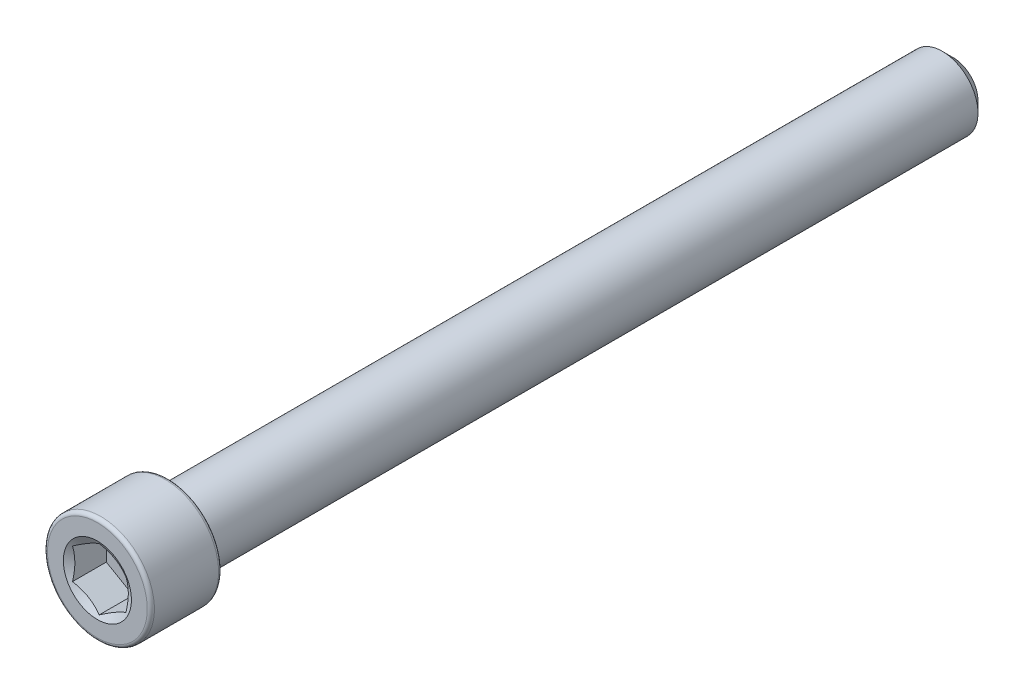
ISO-10303-21;
HEADER;
FILE_DESCRIPTION(('STEP AP214'),'2;1');
FILE_NAME('part.step','',(''),(''),'','','');
FILE_SCHEMA(('AUTOMOTIVE_DESIGN { 1 0 10303 214 1 1 1 1 }'));
ENDSEC;
DATA;
#1=APPLICATION_CONTEXT('core data for automotive mechanical design processes');
#2=APPLICATION_PROTOCOL_DEFINITION('international standard','automotive_design',2000,#1);
#3=PRODUCT_CONTEXT('',#1,'mechanical');
#4=PRODUCT('Part','Part','',(#3));
#5=PRODUCT_RELATED_PRODUCT_CATEGORY('part','',(#4));
#6=PRODUCT_DEFINITION_FORMATION('','',#4);
#7=PRODUCT_DEFINITION_CONTEXT('part definition',#1,'design');
#8=PRODUCT_DEFINITION('design','',#6,#7);
#9=PRODUCT_DEFINITION_SHAPE('','',#8);
#10=(LENGTH_UNIT() NAMED_UNIT(*) SI_UNIT(.MILLI.,.METRE.));
#11=(NAMED_UNIT(*) PLANE_ANGLE_UNIT() SI_UNIT($,.RADIAN.));
#12=(NAMED_UNIT(*) SI_UNIT($,.STERADIAN.) SOLID_ANGLE_UNIT());
#13=UNCERTAINTY_MEASURE_WITH_UNIT(LENGTH_MEASURE(1.E-05),#10,'distance_accuracy_value','');
#14=(GEOMETRIC_REPRESENTATION_CONTEXT(3) GLOBAL_UNCERTAINTY_ASSIGNED_CONTEXT((#13)) GLOBAL_UNIT_ASSIGNED_CONTEXT((#10,
#11,#12)) REPRESENTATION_CONTEXT('',''));
#15=CARTESIAN_POINT('',(0.,0.,0.));
#16=DIRECTION('',(0.,0.,1.));
#17=DIRECTION('',(1.,0.,0.));
#18=AXIS2_PLACEMENT_3D('',#15,#16,#17);
#19=CARTESIAN_POINT('',(0.,0.,-38.1));
#20=DIRECTION('',(0.,0.,-1.));
#21=DIRECTION('',(-1.,0.,0.));
#22=AXIS2_PLACEMENT_3D('',#19,#20,#21);
#23=PLANE('',#22);
#24=CARTESIAN_POINT('',(0.,0.,-38.1));
#25=DIRECTION('',(0.,0.,-1.));
#26=DIRECTION('',(-1.,0.,0.));
#27=AXIS2_PLACEMENT_3D('',#24,#25,#26);
#28=CIRCLE('',#27,2.22250000000004);
#29=CARTESIAN_POINT('',(-2.22250000000004,0.,-38.1));
#30=VERTEX_POINT('',#29);
#31=EDGE_CURVE('E48',#30,#30,#28,.T.);
#32=ORIENTED_EDGE('',*,*,#31,.T.);
#33=EDGE_LOOP('',(#32));
#34=FACE_BOUND('',#33,.T.);
#35=ADVANCED_FACE('F35',(#34),#23,.T.);
#36=CARTESIAN_POINT('',(0.,0.,-38.1));
#37=DIRECTION('',(0.,0.,1.));
#38=DIRECTION('',(1.,0.,0.));
#39=AXIS2_PLACEMENT_3D('',#36,#37,#38);
#40=CONICAL_SURFACE('',#39,2.22250000000004,0.785398163397442);
#41=CARTESIAN_POINT('',(0.,0.,-37.1475));
#42=DIRECTION('',(0.,0.,-1.));
#43=DIRECTION('',(-1.,0.,0.));
#44=AXIS2_PLACEMENT_3D('',#41,#42,#43);
#45=CIRCLE('',#44,3.17500000000003);
#46=CARTESIAN_POINT('',(-3.17500000000003,0.,-37.1475));
#47=VERTEX_POINT('',#46);
#48=EDGE_CURVE('E133',#47,#47,#45,.T.);
#49=ORIENTED_EDGE('',*,*,#48,.T.);
#50=EDGE_LOOP('',(#49));
#51=FACE_BOUND('',#50,.T.);
#52=ORIENTED_EDGE('',*,*,#31,.F.);
#53=EDGE_LOOP('',(#52));
#54=FACE_BOUND('',#53,.T.);
#55=ADVANCED_FACE('F139',(#51,#54),#40,.T.);
#56=CARTESIAN_POINT('',(0.,0.,-38.1));
#57=DIRECTION('',(0.,0.,-1.));
#58=DIRECTION('',(-1.,0.,0.));
#59=AXIS2_PLACEMENT_3D('',#56,#57,#58);
#60=CYLINDRICAL_SURFACE('',#59,3.17500000000002);
#61=CARTESIAN_POINT('',(0.,0.,31.75));
#62=DIRECTION('',(0.,0.,-1.));
#63=DIRECTION('',(-1.,0.,0.));
#64=AXIS2_PLACEMENT_3D('',#61,#62,#63);
#65=CIRCLE('',#64,3.17500000000002);
#66=CARTESIAN_POINT('',(-3.17500000000002,0.,31.75));
#67=VERTEX_POINT('',#66);
#68=EDGE_CURVE('E130',#67,#67,#65,.T.);
#69=ORIENTED_EDGE('',*,*,#68,.T.);
#70=EDGE_LOOP('',(#69));
#71=FACE_BOUND('',#70,.T.);
#72=ORIENTED_EDGE('',*,*,#48,.F.);
#73=EDGE_LOOP('',(#72));
#74=FACE_BOUND('',#73,.T.);
#75=ADVANCED_FACE('F141',(#71,#74),#60,.T.);
#76=CARTESIAN_POINT('',(0.,3.175,31.75));
#77=DIRECTION('',(0.,0.,-1.));
#78=DIRECTION('',(-1.,0.,0.));
#79=AXIS2_PLACEMENT_3D('',#76,#77,#78);
#80=PLANE('',#79);
#81=CARTESIAN_POINT('',(0.,0.,31.75));
#82=DIRECTION('',(0.,0.,-1.));
#83=DIRECTION('',(-1.,0.,0.));
#84=AXIS2_PLACEMENT_3D('',#81,#82,#83);
#85=CIRCLE('',#84,4.445);
#86=CARTESIAN_POINT('',(-4.445,0.,31.75));
#87=VERTEX_POINT('',#86);
#88=EDGE_CURVE('E127',#87,#87,#85,.T.);
#89=ORIENTED_EDGE('',*,*,#88,.T.);
#90=EDGE_LOOP('',(#89));
#91=FACE_BOUND('',#90,.T.);
#92=ORIENTED_EDGE('',*,*,#68,.F.);
#93=EDGE_LOOP('',(#92));
#94=FACE_BOUND('',#93,.T.);
#95=ADVANCED_FACE('F147',(#91,#94),#80,.T.);
#96=CARTESIAN_POINT('',(0.,0.,32.0675));
#97=DIRECTION('',(0.,0.,-1.));
#98=DIRECTION('',(-1.,0.,0.));
#99=AXIS2_PLACEMENT_3D('',#96,#97,#98);
#100=TOROIDAL_SURFACE('',#99,4.445,0.317499999999999);
#101=CARTESIAN_POINT('',(0.,0.,32.0675));
#102=DIRECTION('',(0.,0.,-1.));
#103=DIRECTION('',(-1.,0.,0.));
#104=AXIS2_PLACEMENT_3D('',#101,#102,#103);
#105=CIRCLE('',#104,4.7625);
#106=CARTESIAN_POINT('',(-4.7625,0.,32.0675));
#107=VERTEX_POINT('',#106);
#108=EDGE_CURVE('E124',#107,#107,#105,.T.);
#109=ORIENTED_EDGE('',*,*,#108,.T.);
#110=EDGE_LOOP('',(#109));
#111=FACE_BOUND('',#110,.T.);
#112=ORIENTED_EDGE('',*,*,#88,.F.);
#113=EDGE_LOOP('',(#112));
#114=FACE_BOUND('',#113,.T.);
#115=ADVANCED_FACE('F153',(#111,#114),#100,.T.);
#116=CARTESIAN_POINT('',(0.,0.,-38.1));
#117=DIRECTION('',(0.,0.,-1.));
#118=DIRECTION('',(-1.,0.,0.));
#119=AXIS2_PLACEMENT_3D('',#116,#117,#118);
#120=CYLINDRICAL_SURFACE('',#119,4.7625);
#121=CARTESIAN_POINT('',(0.,0.,37.7825));
#122=DIRECTION('',(0.,0.,-1.));
#123=DIRECTION('',(-1.,0.,0.));
#124=AXIS2_PLACEMENT_3D('',#121,#122,#123);
#125=CIRCLE('',#124,4.7625);
#126=CARTESIAN_POINT('',(-4.7625,0.,37.7825));
#127=VERTEX_POINT('',#126);
#128=EDGE_CURVE('E121',#127,#127,#125,.T.);
#129=ORIENTED_EDGE('',*,*,#128,.T.);
#130=EDGE_LOOP('',(#129));
#131=FACE_BOUND('',#130,.T.);
#132=ORIENTED_EDGE('',*,*,#108,.F.);
#133=EDGE_LOOP('',(#132));
#134=FACE_BOUND('',#133,.T.);
#135=ADVANCED_FACE('F157',(#131,#134),#120,.T.);
#136=CARTESIAN_POINT('',(0.,0.,37.7825));
#137=DIRECTION('',(0.,0.,-1.));
#138=DIRECTION('',(-1.,0.,0.));
#139=AXIS2_PLACEMENT_3D('',#136,#137,#138);
#140=TOROIDAL_SURFACE('',#139,4.445,0.3175);
#141=CARTESIAN_POINT('',(0.,0.,38.1));
#142=DIRECTION('',(0.,0.,-1.));
#143=DIRECTION('',(-1.,0.,0.));
#144=AXIS2_PLACEMENT_3D('',#141,#142,#143);
#145=CIRCLE('',#144,4.445);
#146=CARTESIAN_POINT('',(-4.445,0.,38.1));
#147=VERTEX_POINT('',#146);
#148=EDGE_CURVE('E118',#147,#147,#145,.T.);
#149=ORIENTED_EDGE('',*,*,#148,.T.);
#150=EDGE_LOOP('',(#149));
#151=FACE_BOUND('',#150,.T.);
#152=ORIENTED_EDGE('',*,*,#128,.F.);
#153=EDGE_LOOP('',(#152));
#154=FACE_BOUND('',#153,.T.);
#155=ADVANCED_FACE('F161',(#151,#154),#140,.T.);
#156=CARTESIAN_POINT('',(0.,4.44499999999999,38.1));
#157=DIRECTION('',(0.,0.,1.));
#158=DIRECTION('',(1.,0.,0.));
#159=AXIS2_PLACEMENT_3D('',#156,#157,#158);
#160=PLANE('',#159);
#161=CARTESIAN_POINT('',(0.,0.,38.1));
#162=DIRECTION('',(0.,0.,1.));
#163=DIRECTION('',(1.,0.,0.));
#164=AXIS2_PLACEMENT_3D('',#161,#162,#163);
#165=CIRCLE('',#164,3.03219221417965);
#166=CARTESIAN_POINT('',(3.03219221417965,0.,38.1));
#167=VERTEX_POINT('',#166);
#168=EDGE_CURVE('E255',#167,#167,#165,.T.);
#169=ORIENTED_EDGE('',*,*,#168,.F.);
#170=EDGE_LOOP('',(#169));
#171=FACE_BOUND('',#170,.T.);
#172=ORIENTED_EDGE('',*,*,#148,.F.);
#173=EDGE_LOOP('',(#172));
#174=FACE_BOUND('',#173,.T.);
#175=ADVANCED_FACE('F165',(#171,#174),#160,.T.);
#176=CARTESIAN_POINT('',(0.,0.,38.1));
#177=DIRECTION('',(0.,0.,1.));
#178=DIRECTION('',(1.,0.,0.));
#179=AXIS2_PLACEMENT_3D('',#176,#177,#178);
#180=CONICAL_SURFACE('',#179,3.03219221417965,1.0471975511966);
#181=ORIENTED_EDGE('',*,*,#168,.T.);
#182=EDGE_LOOP('',(#181));
#183=FACE_BOUND('',#182,.T.);
#184=CARTESIAN_POINT('',(2.38144999999999,1.37469985845395,37.9369296797747));
#185=CARTESIAN_POINT('',(2.27680510857801,1.43511661468574,37.9020335875339));
#186=CARTESIAN_POINT('',(2.17125693139549,1.49605488319455,37.8702965816836));
#187=CARTESIAN_POINT('',(1.95833280582788,1.61898668440797,37.8148986717318));
#188=CARTESIAN_POINT('',(1.85095307338657,1.68098240183847,37.7912573664923));
#189=CARTESIAN_POINT('',(1.63752441306378,1.80420549632862,37.7544553443056));
#190=CARTESIAN_POINT('',(1.53150832846242,1.86541391131164,37.7410497054727));
#191=CARTESIAN_POINT('',(1.31897718209788,1.98811882587639,37.7250446234132));
#192=CARTESIAN_POINT('',(1.21246289310218,2.0496148793006,37.7224319282234));
#193=CARTESIAN_POINT('',(1.01342600969027,2.16452887751713,37.7278600893658));
#194=CARTESIAN_POINT('',(0.920873657438133,2.21796400300403,37.7345681458576));
#195=CARTESIAN_POINT('',(0.736371946153151,2.32448611568036,37.7558309696216));
#196=CARTESIAN_POINT('',(0.644423225529251,2.37757273428422,37.7703930040322));
#197=CARTESIAN_POINT('',(0.459540942889934,2.48431456993442,37.8067978377252));
#198=CARTESIAN_POINT('',(0.366630787034619,2.53795627342793,37.8287949938814));
#199=CARTESIAN_POINT('',(0.182196405744559,2.64443951311357,37.8787202236105));
#200=CARTESIAN_POINT('',(0.0906698164537917,2.6972824140786,37.9066365624169));
#201=CARTESIAN_POINT('',(-0.00020000000000298,2.74974612706942,37.9369296797747));
#202=B_SPLINE_CURVE_WITH_KNOTS('',3,(#184,#185,#186,#187,#188,#189,#190,#191,#192,#193,#194,
#195,#196,#197,#198,#199,#200,#201),.UNSPECIFIED.,.F.,.F.,(4,2,2,2,2,2,2,2,4),(0.,
0.37746300172044,0.755833447356083,1.1248388545394,1.49339104874266,1.81432726847352,
2.13556095518869,2.4639212191382,2.791636496483),.UNSPECIFIED.);
#203=CARTESIAN_POINT('',(2.38124999999999,1.37481532850779,37.9368630089087));
#204=VERTEX_POINT('',#203);
#205=CARTESIAN_POINT('',(0.,2.74963065701558,37.9368630089087));
#206=VERTEX_POINT('',#205);
#207=EDGE_CURVE('E102',#204,#206,#202,.T.);
#208=ORIENTED_EDGE('',*,*,#207,.F.);
#209=CARTESIAN_POINT('',(2.38124999999999,-3.59976633824536,38.8412611644295));
#210=CARTESIAN_POINT('',(2.38124999999999,-3.49646395881335,38.7915324836855));
#211=CARTESIAN_POINT('',(2.38124999999999,-3.39291407009263,38.7423085892494));
#212=CARTESIAN_POINT('',(2.38124999999999,-3.18518717181845,38.6451564977165));
#213=CARTESIAN_POINT('',(2.38124999999999,-3.08101005703531,38.5972285258865));
#214=CARTESIAN_POINT('',(2.38124999999999,-2.87131401421191,38.5026930902144));
#215=CARTESIAN_POINT('',(2.38124999999999,-2.76579079437245,38.4560951113206));
#216=CARTESIAN_POINT('',(2.38124999999999,-2.55387118203945,38.3649364827971));
#217=CARTESIAN_POINT('',(2.38124999999999,-2.44747483422771,38.3203757296712));
#218=CARTESIAN_POINT('',(2.38124999999999,-2.23067196845909,38.232631851781));
#219=CARTESIAN_POINT('',(2.38124999999999,-2.12023600195454,38.1895210708126));
#220=CARTESIAN_POINT('',(2.38124999999999,-1.89803839134692,38.1067937390092));
#221=CARTESIAN_POINT('',(2.38124999999999,-1.78627659559216,38.0671775923576));
#222=CARTESIAN_POINT('',(2.38124999999999,-1.56149041735538,37.9925477895721));
#223=CARTESIAN_POINT('',(2.38124999999999,-1.4484694476167,37.9575239630361));
#224=CARTESIAN_POINT('',(2.38124999999999,-1.22081073511454,37.8932629117452));
#225=CARTESIAN_POINT('',(2.38124999999999,-1.10617354309387,37.8640237645329));
#226=CARTESIAN_POINT('',(2.38124999999999,-0.87579075687879,37.8129337388859));
#227=CARTESIAN_POINT('',(2.38124999999999,-0.760052762621301,37.7910492449066));
#228=CARTESIAN_POINT('',(2.38124999999999,-0.527241538813736,37.7559822843521));
#229=CARTESIAN_POINT('',(2.38124999999999,-0.410168413785965,37.7427991412742));
#230=CARTESIAN_POINT('',(2.38124999999999,-0.176757909156526,37.7263592365983));
#231=CARTESIAN_POINT('',(2.38124999999999,-0.0604292020566075,37.7229823294229));
#232=CARTESIAN_POINT('',(2.38124999999999,0.17210252649544,37.7261301571011));
#233=CARTESIAN_POINT('',(2.38124999999999,0.288305540624633,37.7326554407246));
#234=CARTESIAN_POINT('',(2.38124999999999,0.488407104907263,37.7519728989663));
#235=CARTESIAN_POINT('',(2.38124999999999,0.572526768128158,37.7625877365416));
#236=CARTESIAN_POINT('',(2.38124999999999,0.74008592875166,37.7882929254538));
#237=CARTESIAN_POINT('',(2.38124999999999,0.8235253196623,37.8033839641938));
#238=CARTESIAN_POINT('',(2.38124999999999,1.07273325586547,37.85457343129));
#239=CARTESIAN_POINT('',(2.38124999999999,1.23729002677746,37.8965771837148));
#240=CARTESIAN_POINT('',(2.38124999999999,1.56668315583935,37.9929511253518));
#241=CARTESIAN_POINT('',(2.38124999999999,1.73144052822359,38.0475811694067));
#242=CARTESIAN_POINT('',(2.38124999999999,1.97631292230748,38.1356187750601));
#243=CARTESIAN_POINT('',(2.38124999999999,2.05754928439702,38.1659756920629));
#244=CARTESIAN_POINT('',(2.38124999999999,2.21936297141559,38.2283957224258));
#245=CARTESIAN_POINT('',(2.38124999999999,2.29994030817706,38.2604588050747));
#246=CARTESIAN_POINT('',(2.38124999999999,2.5091120281204,38.3458324530248));
#247=CARTESIAN_POINT('',(2.38124999999999,2.63725060996071,38.40025731756));
#248=CARTESIAN_POINT('',(2.38124999999999,2.89233256605392,38.5118480388214));
#249=CARTESIAN_POINT('',(2.38124999999999,3.01927584315839,38.5690141160782));
#250=CARTESIAN_POINT('',(2.38124999999999,3.27222855247939,38.6854567661809));
#251=CARTESIAN_POINT('',(2.38124999999999,3.39823772867163,38.7447338935472));
#252=CARTESIAN_POINT('',(2.38124999999999,3.64947609912466,38.8649213116136));
#253=CARTESIAN_POINT('',(2.38124999999999,3.77470527471068,38.925831641232));
#254=CARTESIAN_POINT('',(2.38124999999999,4.14976436460612,39.1106293734581));
#255=CARTESIAN_POINT('',(2.38124999999999,4.39864815512715,39.2364349728279));
#256=CARTESIAN_POINT('',(2.38124999999999,4.89467625611779,39.4913121050035));
#257=CARTESIAN_POINT('',(2.38124999999999,5.14182083564056,39.6203831177985));
#258=CARTESIAN_POINT('',(2.38124999999999,5.61084172457359,39.868066970761));
#259=CARTESIAN_POINT('',(2.38124999999999,5.83282885020019,39.9864703062649));
#260=CARTESIAN_POINT('',(2.38124999999999,6.27608857926104,40.2246296719868));
#261=CARTESIAN_POINT('',(2.38124999999999,6.49736114870038,40.3443857653776));
#262=CARTESIAN_POINT('',(2.38124999999999,6.93875603869058,40.5845822776973));
#263=CARTESIAN_POINT('',(2.38124999999999,7.15887985119655,40.7050199580106));
#264=CARTESIAN_POINT('',(2.38124999999999,7.59868091402183,40.946675883145));
#265=CARTESIAN_POINT('',(2.38124999999999,7.81835819130603,41.0678940788724));
#266=CARTESIAN_POINT('',(2.38124999999999,8.03787642276087,41.1893977522439));
#267=B_SPLINE_CURVE_WITH_KNOTS('',3,(#209,#210,#211,#212,#213,#214,#215,#216,#217,#218,#219,
#220,#221,#222,#223,#224,#225,#226,#227,#228,#229,#230,#231,#232,#233,#234,#235,#236,#237,#238,
#239,#240,#241,#242,#243,#244,#245,#246,#247,#248,#249,#250,#251,#252,#253,#254,#255,#256,#257,
#258,#259,#260,#261,#262,#263,#264,#265,#266),.UNSPECIFIED.,.F.,.F.,(4,2,2,2,2,2,2,2,2,2,2,2,2,
2,2,2,2,2,2,2,2,2,2,2,2,2,2,2,4),(0.,0.343950780921492,0.687960970461105,1.0340054839437,
1.38003239789181,1.73564357991986,2.09129583755095,2.44614664320016,2.80087932031081,
3.15396785782398,3.50702894058493,3.8557456967058,4.20448177908074,4.45871798756717,
4.71299325892998,5.22184880640698,5.74229337432344,6.00244751925213,6.26259698295639,
6.6802041123157,7.09784489471857,7.51559620207537,7.93335747307521,8.76993188334094,
9.60637389902891,10.3611381643167,11.1159378234817,11.8686893766333,12.6213940361871),.UNSPECIFIED.);
#268=CARTESIAN_POINT('',(2.38124999999999,-1.37481532850779,37.9368630089087));
#269=VERTEX_POINT('',#268);
#270=EDGE_CURVE('E211',#269,#204,#267,.T.);
#271=ORIENTED_EDGE('',*,*,#270,.F.);
#272=CARTESIAN_POINT('',(-0.000200000000001796,-2.74974612706942,37.9369296797747));
#273=CARTESIAN_POINT('',(0.104444891421972,-2.68932937083762,37.9020335875339));
#274=CARTESIAN_POINT('',(0.209993068604492,-2.62839110232882,37.8702965816836));
#275=CARTESIAN_POINT('',(0.422917194172105,-2.50545930111539,37.8148986717318));
#276=CARTESIAN_POINT('',(0.530296926613413,-2.44346358368489,37.7912573664923));
#277=CARTESIAN_POINT('',(0.743725586936208,-2.32024048919474,37.7544553443056));
#278=CARTESIAN_POINT('',(0.84974167153756,-2.25903207421172,37.7410497054727));
#279=CARTESIAN_POINT('',(1.06227281790211,-2.13632715964697,37.7250446234132));
#280=CARTESIAN_POINT('',(1.16878710689781,-2.07483110622276,37.7224319282234));
#281=CARTESIAN_POINT('',(1.36782399030971,-1.95991710800623,37.7278600893658));
#282=CARTESIAN_POINT('',(1.46037634256185,-1.90648198251933,37.7345681458576));
#283=CARTESIAN_POINT('',(1.64487805384683,-1.799959869843,37.7558309696216));
#284=CARTESIAN_POINT('',(1.73682677447073,-1.74687325123915,37.7703930040322));
#285=CARTESIAN_POINT('',(1.92170905711005,-1.64013141558895,37.8067978377252));
#286=CARTESIAN_POINT('',(2.01461921296537,-1.58648971209543,37.8287949938814));
#287=CARTESIAN_POINT('',(2.19905359425543,-1.48000647240979,37.8787202236105));
#288=CARTESIAN_POINT('',(2.29058018354619,-1.42716357144476,37.9066365624169));
#289=CARTESIAN_POINT('',(2.38144999999999,-1.37469985845395,37.9369296797747));
#290=B_SPLINE_CURVE_WITH_KNOTS('',3,(#272,#273,#274,#275,#276,#277,#278,#279,#280,#281,#282,
#283,#284,#285,#286,#287,#288,#289),.UNSPECIFIED.,.F.,.F.,(4,2,2,2,2,2,2,2,4),(0.,
0.377463001720438,0.755833447356082,1.1248388545394,1.49339104874266,1.81432726847353,
2.13556095518869,2.46392121913819,2.791636496483),.UNSPECIFIED.);
#291=CARTESIAN_POINT('',(0.,-2.74963065701558,37.9368630089087));
#292=VERTEX_POINT('',#291);
#293=EDGE_CURVE('E205',#292,#269,#290,.T.);
#294=ORIENTED_EDGE('',*,*,#293,.F.);
#295=CARTESIAN_POINT('',(-2.38144999999999,-1.37469985845395,37.9369296797747));
#296=CARTESIAN_POINT('',(-2.27680510857801,-1.43511661468575,37.9020335875339));
#297=CARTESIAN_POINT('',(-2.17125693139549,-1.49605488319455,37.8702965816836));
#298=CARTESIAN_POINT('',(-1.95833280582788,-1.61898668440798,37.8148986717318));
#299=CARTESIAN_POINT('',(-1.85095307338657,-1.68098240183848,37.7912573664923));
#300=CARTESIAN_POINT('',(-1.63752441306378,-1.80420549632862,37.7544553443056));
#301=CARTESIAN_POINT('',(-1.53150832846243,-1.86541391131164,37.7410497054727));
#302=CARTESIAN_POINT('',(-1.31897718209788,-1.9881188258764,37.7250446234132));
#303=CARTESIAN_POINT('',(-1.21246289310218,-2.0496148793006,37.7224319282234));
#304=CARTESIAN_POINT('',(-1.01342600969027,-2.16452887751713,37.7278600893658));
#305=CARTESIAN_POINT('',(-0.920873657438134,-2.21796400300404,37.7345681458576));
#306=CARTESIAN_POINT('',(-0.736371946153152,-2.32448611568037,37.7558309696216));
#307=CARTESIAN_POINT('',(-0.644423225529253,-2.37757273428422,37.7703930040322));
#308=CARTESIAN_POINT('',(-0.459540942889936,-2.48431456993442,37.8067978377252));
#309=CARTESIAN_POINT('',(-0.366630787034622,-2.53795627342794,37.8287949938814));
#310=CARTESIAN_POINT('',(-0.182196405744563,-2.64443951311357,37.8787202236105));
#311=CARTESIAN_POINT('',(-0.0906698164537961,-2.69728241407861,37.9066365624169));
#312=CARTESIAN_POINT('',(0.0001999999999983,-2.74974612706942,37.9369296797747));
#313=B_SPLINE_CURVE_WITH_KNOTS('',3,(#295,#296,#297,#298,#299,#300,#301,#302,#303,#304,#305,
#306,#307,#308,#309,#310,#311,#312),.UNSPECIFIED.,.F.,.F.,(4,2,2,2,2,2,2,2,4),(0.,
0.377463001720437,0.755833447356083,1.1248388545394,1.49339104874266,1.81432726847353,
2.13556095518869,2.46392121913819,2.79163649648299),.UNSPECIFIED.);
#314=CARTESIAN_POINT('',(-2.38124999999999,-1.37481532850779,37.9368630089087));
#315=VERTEX_POINT('',#314);
#316=EDGE_CURVE('E55',#315,#292,#313,.T.);
#317=ORIENTED_EDGE('',*,*,#316,.F.);
#318=CARTESIAN_POINT('',(-2.38124999999999,-3.59976633839615,38.8412611645021));
#319=CARTESIAN_POINT('',(-2.38124999999999,-3.49646395895908,38.7915324837551));
#320=CARTESIAN_POINT('',(-2.38124999999999,-3.3929140702333,38.7423085893158));
#321=CARTESIAN_POINT('',(-2.38124999999999,-3.18518717194897,38.6451564977768));
#322=CARTESIAN_POINT('',(-2.38124999999999,-3.08101005716076,38.5972285259438));
#323=CARTESIAN_POINT('',(-2.38124999999999,-2.87131401432711,38.5026930902656));
#324=CARTESIAN_POINT('',(-2.38124999999999,-2.76579079448248,38.4560951113687));
#325=CARTESIAN_POINT('',(-2.38124999999999,-2.55387118213911,38.3649364828392));
#326=CARTESIAN_POINT('',(-2.38124999999999,-2.44747483432216,38.3203757297102));
#327=CARTESIAN_POINT('',(-2.38124999999999,-2.23067196854282,38.232631851814));
#328=CARTESIAN_POINT('',(-2.38124999999999,-2.12023600203275,38.1895210708426));
#329=CARTESIAN_POINT('',(-2.38124999999999,-1.89803839141401,38.1067937390333));
#330=CARTESIAN_POINT('',(-2.38124999999999,-1.78627659565364,38.0671775923788));
#331=CARTESIAN_POINT('',(-2.38124999999999,-1.56149041740554,37.9925477895879));
#332=CARTESIAN_POINT('',(-2.38124999999999,-1.44846944766115,37.9575239630494));
#333=CARTESIAN_POINT('',(-2.38124999999999,-1.22081073514739,37.8932629117537));
#334=CARTESIAN_POINT('',(-2.38124999999999,-1.10617354312085,37.8640237645394));
#335=CARTESIAN_POINT('',(-2.38124999999999,-0.875790756890795,37.8129337388881));
#336=CARTESIAN_POINT('',(-2.38124999999999,-0.760052762624165,37.7910492449069));
#337=CARTESIAN_POINT('',(-2.38124999999999,-0.527241538798119,37.7559822843499));
#338=CARTESIAN_POINT('',(-2.38124999999999,-0.41016841376101,37.7427991412715));
#339=CARTESIAN_POINT('',(-2.38124999999999,-0.176757909113057,37.7263592365962));
#340=CARTESIAN_POINT('',(-2.38124999999999,-0.0604292020039644,37.7229823294219));
#341=CARTESIAN_POINT('',(-2.38124999999999,0.172102526566265,37.7261301571037));
#342=CARTESIAN_POINT('',(-2.38124999999999,0.288305540704466,37.7326554407299));
#343=CARTESIAN_POINT('',(-2.38124999999999,0.488407104998749,37.7519728989769));
#344=CARTESIAN_POINT('',(-2.38124999999999,0.572526768222386,37.7625877365543));
#345=CARTESIAN_POINT('',(-2.38124999999999,0.740085928851259,37.7882929254708));
#346=CARTESIAN_POINT('',(-2.38124999999999,0.823525319764528,37.8033839642131));
#347=CARTESIAN_POINT('',(-2.38124999999999,1.07273325597546,37.854573431316));
#348=CARTESIAN_POINT('',(-2.38124999999999,1.23729002689244,37.8965771837454));
#349=CARTESIAN_POINT('',(-2.38124999999999,1.56668315596438,37.9929511253914));
#350=CARTESIAN_POINT('',(-2.38124999999999,1.73144052835366,38.0475811694509));
#351=CARTESIAN_POINT('',(-2.38124999999999,1.97631292244509,38.1356187751109));
#352=CARTESIAN_POINT('',(-2.38124999999999,2.05754928453713,38.1659756921158));
#353=CARTESIAN_POINT('',(-2.38124999999999,2.2193629715607,38.228395722483));
#354=CARTESIAN_POINT('',(-2.38124999999999,2.29994030832468,38.2604588051339));
#355=CARTESIAN_POINT('',(-2.38124999999999,2.50911202826962,38.3458324530874));
#356=CARTESIAN_POINT('',(-2.38124999999999,2.63725061010909,38.4002573176237));
#357=CARTESIAN_POINT('',(-2.38124999999999,2.89233256620072,38.5118480388869));
#358=CARTESIAN_POINT('',(-2.38124999999999,3.01927584330445,38.5690141161445));
#359=CARTESIAN_POINT('',(-2.38124999999999,3.27222855262406,38.6854567662484));
#360=CARTESIAN_POINT('',(-2.38124999999999,3.39823772881564,38.7447338936153));
#361=CARTESIAN_POINT('',(-2.38124999999999,3.64947609926741,38.8649213116827));
#362=CARTESIAN_POINT('',(-2.38124999999999,3.77470527485284,38.9258316413015));
#363=CARTESIAN_POINT('',(-2.38124999999999,4.14976436474653,39.1106293735285));
#364=CARTESIAN_POINT('',(-2.38124999999999,4.39864815526647,39.2364349728987));
#365=CARTESIAN_POINT('',(-2.38124999999999,4.89467625625506,39.4913121050749));
#366=CARTESIAN_POINT('',(-2.38124999999999,5.14182083577688,39.6203831178699));
#367=CARTESIAN_POINT('',(-2.38124999999999,5.61084172470906,39.868066970833));
#368=CARTESIAN_POINT('',(-2.38124999999999,5.83282885033573,39.9864703063374));
#369=CARTESIAN_POINT('',(-2.38124999999999,6.27608857939678,40.2246296720601));
#370=CARTESIAN_POINT('',(-2.38124999999999,6.49736114883623,40.3443857654512));
#371=CARTESIAN_POINT('',(-2.38124999999999,6.93875603882681,40.5845822777716));
#372=CARTESIAN_POINT('',(-2.38124999999999,7.15887985133303,40.7050199580853));
#373=CARTESIAN_POINT('',(-2.38124999999999,7.59868091415884,40.9466758832205));
#374=CARTESIAN_POINT('',(-2.38124999999999,7.81835819144332,41.0678940789483));
#375=CARTESIAN_POINT('',(-2.38124999999999,8.03787642289845,41.18939775232));
#376=B_SPLINE_CURVE_WITH_KNOTS('',3,(#318,#319,#320,#321,#322,#323,#324,#325,#326,#327,#328,
#329,#330,#331,#332,#333,#334,#335,#336,#337,#338,#339,#340,#341,#342,#343,#344,#345,#346,#347,
#348,#349,#350,#351,#352,#353,#354,#355,#356,#357,#358,#359,#360,#361,#362,#363,#364,#365,#366,
#367,#368,#369,#370,#371,#372,#373,#374,#375),.UNSPECIFIED.,.F.,.F.,(4,2,2,2,2,2,2,2,2,2,2,2,2,
2,2,2,2,2,2,2,2,2,2,2,2,2,2,2,4),(0.,0.34395078093916,0.687960970496446,1.03400548399692,
1.38003239796294,1.73564358000971,2.09129583765951,2.44614664332736,2.80087932045664,
3.15396785799777,3.50702894078664,3.85574569693482,4.2044817793371,4.45871798783248,
4.71299325920425,5.22184880669918,5.74229337463427,6.00244751957226,6.26259698328581,
6.68020411264408,7.09784489504589,7.51559620240161,7.93335747340035,8.76993188366371,
9.60637389934933,10.361138164638,11.1159378238038,11.8686893769566,12.6213940365117),.UNSPECIFIED.);
#377=CARTESIAN_POINT('',(-2.38124999999999,1.37481532850779,37.9368630089087));
#378=VERTEX_POINT('',#377);
#379=EDGE_CURVE('E11',#378,#315,#376,.F.);
#380=ORIENTED_EDGE('',*,*,#379,.F.);
#381=CARTESIAN_POINT('',(0.000199999999997304,2.74974612706942,37.9369296797747));
#382=CARTESIAN_POINT('',(-0.104444891421977,2.68932937083762,37.9020335875339));
#383=CARTESIAN_POINT('',(-0.209993068604496,2.62839110232882,37.8702965816836));
#384=CARTESIAN_POINT('',(-0.42291719417211,2.50545930111539,37.8148986717318));
#385=CARTESIAN_POINT('',(-0.530296926613419,2.44346358368489,37.7912573664923));
#386=CARTESIAN_POINT('',(-0.743725586936213,2.32024048919474,37.7544553443056));
#387=CARTESIAN_POINT('',(-0.849741671537566,2.25903207421172,37.7410497054727));
#388=CARTESIAN_POINT('',(-1.06227281790211,2.13632715964697,37.7250446234132));
#389=CARTESIAN_POINT('',(-1.16878710689781,2.07483110622276,37.7224319282234));
#390=CARTESIAN_POINT('',(-1.36782399030972,1.95991710800623,37.7278600893658));
#391=CARTESIAN_POINT('',(-1.46037634256186,1.90648198251933,37.7345681458576));
#392=CARTESIAN_POINT('',(-1.64487805384684,1.799959869843,37.7558309696216));
#393=CARTESIAN_POINT('',(-1.73682677447074,1.74687325123915,37.7703930040322));
#394=CARTESIAN_POINT('',(-1.92170905711005,1.64013141558895,37.8067978377252));
#395=CARTESIAN_POINT('',(-2.01461921296537,1.58648971209543,37.8287949938814));
#396=CARTESIAN_POINT('',(-2.19905359425543,1.48000647240979,37.8787202236105));
#397=CARTESIAN_POINT('',(-2.29058018354619,1.42716357144476,37.9066365624169));
#398=CARTESIAN_POINT('',(-2.38144999999999,1.37469985845395,37.9369296797747));
#399=B_SPLINE_CURVE_WITH_KNOTS('',3,(#381,#382,#383,#384,#385,#386,#387,#388,#389,#390,#391,
#392,#393,#394,#395,#396,#397,#398),.UNSPECIFIED.,.F.,.F.,(4,2,2,2,2,2,2,2,4),(0.,
0.377463001720438,0.755833447356083,1.1248388545394,1.49339104874266,1.81432726847353,
2.13556095518869,2.46392121913819,2.79163649648299),.UNSPECIFIED.);
#400=EDGE_CURVE('E93',#206,#378,#399,.T.);
#401=ORIENTED_EDGE('',*,*,#400,.F.);
#402=EDGE_LOOP('',(#208,#271,#294,#317,#380,#401));
#403=FACE_BOUND('',#402,.T.);
#404=ADVANCED_FACE('F92',(#183,#403),#180,.F.);
#405=CARTESIAN_POINT('',(0.,0.,34.925));
#406=DIRECTION('',(0.,0.,1.));
#407=DIRECTION('',(1.,0.,0.));
#408=AXIS2_PLACEMENT_3D('',#405,#406,#407);
#409=PLANE('',#408);
#410=DIRECTION('',(-0.866025403784439,-0.5,0.));
#411=VECTOR('',#410,1.);
#412=CARTESIAN_POINT('',(0.,2.74963065701558,34.925));
#413=LINE('',#412,#411);
#414=CARTESIAN_POINT('',(0.,2.74963065701558,34.925));
#415=VERTEX_POINT('',#414);
#416=CARTESIAN_POINT('',(-2.38124999999999,1.37481532850779,34.925));
#417=VERTEX_POINT('',#416);
#418=EDGE_CURVE('E101',#415,#417,#413,.T.);
#419=ORIENTED_EDGE('',*,*,#418,.T.);
#420=DIRECTION('',(0.,-1.,0.));
#421=VECTOR('',#420,1.);
#422=CARTESIAN_POINT('',(-2.38124999999999,1.37481532850779,34.925));
#423=LINE('',#422,#421);
#424=CARTESIAN_POINT('',(-2.38124999999999,-1.37481532850779,34.925));
#425=VERTEX_POINT('',#424);
#426=EDGE_CURVE('E106',#417,#425,#423,.T.);
#427=ORIENTED_EDGE('',*,*,#426,.T.);
#428=DIRECTION('',(0.866025403784439,-0.5,0.));
#429=VECTOR('',#428,1.);
#430=CARTESIAN_POINT('',(-2.38124999999999,-1.37481532850779,34.925));
#431=LINE('',#430,#429);
#432=CARTESIAN_POINT('',(0.,-2.74963065701558,34.925));
#433=VERTEX_POINT('',#432);
#434=EDGE_CURVE('E237',#425,#433,#431,.T.);
#435=ORIENTED_EDGE('',*,*,#434,.T.);
#436=DIRECTION('',(0.866025403784439,0.5,0.));
#437=VECTOR('',#436,1.);
#438=CARTESIAN_POINT('',(0.,-2.74963065701558,34.925));
#439=LINE('',#438,#437);
#440=CARTESIAN_POINT('',(2.38124999999999,-1.37481532850779,34.925));
#441=VERTEX_POINT('',#440);
#442=EDGE_CURVE('E241',#433,#441,#439,.T.);
#443=ORIENTED_EDGE('',*,*,#442,.T.);
#444=DIRECTION('',(0.,1.,0.));
#445=VECTOR('',#444,1.);
#446=CARTESIAN_POINT('',(2.38124999999999,-1.37481532850779,34.925));
#447=LINE('',#446,#445);
#448=CARTESIAN_POINT('',(2.38124999999999,1.37481532850779,34.925));
#449=VERTEX_POINT('',#448);
#450=EDGE_CURVE('E114',#441,#449,#447,.T.);
#451=ORIENTED_EDGE('',*,*,#450,.T.);
#452=DIRECTION('',(-0.866025403784439,0.5,0.));
#453=VECTOR('',#452,1.);
#454=CARTESIAN_POINT('',(2.38124999999999,1.37481532850779,34.925));
#455=LINE('',#454,#453);
#456=EDGE_CURVE('E109',#449,#415,#455,.T.);
#457=ORIENTED_EDGE('',*,*,#456,.T.);
#458=EDGE_LOOP('',(#419,#427,#435,#443,#451,#457));
#459=FACE_BOUND('',#458,.T.);
#460=ADVANCED_FACE('F191',(#459),#409,.T.);
#461=CARTESIAN_POINT('',(-2.38124999999999,1.37481532850779,34.925));
#462=DIRECTION('',(-1.,0.,0.));
#463=DIRECTION('',(0.,-1.,0.));
#464=AXIS2_PLACEMENT_3D('',#461,#462,#463);
#465=PLANE('',#464);
#466=DIRECTION('',(0.,0.,1.));
#467=VECTOR('',#466,1.);
#468=CARTESIAN_POINT('',(-2.38124999999999,1.37481532850779,34.925));
#469=LINE('',#468,#467);
#470=EDGE_CURVE('E99',#417,#378,#469,.T.);
#471=ORIENTED_EDGE('',*,*,#470,.T.);
#472=ORIENTED_EDGE('',*,*,#379,.T.);
#473=DIRECTION('',(0.,0.,1.));
#474=VECTOR('',#473,1.);
#475=CARTESIAN_POINT('',(-2.38124999999999,-1.37481532850779,34.925));
#476=LINE('',#475,#474);
#477=EDGE_CURVE('E108',#425,#315,#476,.T.);
#478=ORIENTED_EDGE('',*,*,#477,.F.);
#479=ORIENTED_EDGE('',*,*,#426,.F.);
#480=EDGE_LOOP('',(#471,#472,#478,#479));
#481=FACE_BOUND('',#480,.T.);
#482=ADVANCED_FACE('F104',(#481),#465,.F.);
#483=CARTESIAN_POINT('',(-2.38124999999999,-1.37481532850779,34.925));
#484=DIRECTION('',(-0.5,-0.866025403784439,0.));
#485=DIRECTION('',(0.866025403784439,-0.5,0.));
#486=AXIS2_PLACEMENT_3D('',#483,#484,#485);
#487=PLANE('',#486);
#488=ORIENTED_EDGE('',*,*,#477,.T.);
#489=ORIENTED_EDGE('',*,*,#316,.T.);
#490=DIRECTION('',(0.,0.,1.));
#491=VECTOR('',#490,1.);
#492=CARTESIAN_POINT('',(0.,-2.74963065701558,34.925));
#493=LINE('',#492,#491);
#494=EDGE_CURVE('E111',#433,#292,#493,.T.);
#495=ORIENTED_EDGE('',*,*,#494,.F.);
#496=ORIENTED_EDGE('',*,*,#434,.F.);
#497=EDGE_LOOP('',(#488,#489,#495,#496));
#498=FACE_BOUND('',#497,.T.);
#499=ADVANCED_FACE('F226',(#498),#487,.F.);
#500=CARTESIAN_POINT('',(0.,-2.74963065701558,34.925));
#501=DIRECTION('',(0.5,-0.866025403784439,0.));
#502=DIRECTION('',(0.866025403784439,0.5,0.));
#503=AXIS2_PLACEMENT_3D('',#500,#501,#502);
#504=PLANE('',#503);
#505=ORIENTED_EDGE('',*,*,#494,.T.);
#506=ORIENTED_EDGE('',*,*,#293,.T.);
#507=DIRECTION('',(0.,0.,1.));
#508=VECTOR('',#507,1.);
#509=CARTESIAN_POINT('',(2.38124999999999,-1.37481532850779,34.925));
#510=LINE('',#509,#508);
#511=EDGE_CURVE('E251',#441,#269,#510,.T.);
#512=ORIENTED_EDGE('',*,*,#511,.F.);
#513=ORIENTED_EDGE('',*,*,#442,.F.);
#514=EDGE_LOOP('',(#505,#506,#512,#513));
#515=FACE_BOUND('',#514,.T.);
#516=ADVANCED_FACE('F221',(#515),#504,.F.);
#517=CARTESIAN_POINT('',(2.38124999999999,-1.37481532850779,34.925));
#518=DIRECTION('',(1.,0.,0.));
#519=DIRECTION('',(0.,0.,-1.));
#520=AXIS2_PLACEMENT_3D('',#517,#518,#519);
#521=PLANE('',#520);
#522=ORIENTED_EDGE('',*,*,#511,.T.);
#523=ORIENTED_EDGE('',*,*,#270,.T.);
#524=DIRECTION('',(0.,0.,1.));
#525=VECTOR('',#524,1.);
#526=CARTESIAN_POINT('',(2.38124999999999,1.37481532850779,34.925));
#527=LINE('',#526,#525);
#528=EDGE_CURVE('E248',#449,#204,#527,.T.);
#529=ORIENTED_EDGE('',*,*,#528,.F.);
#530=ORIENTED_EDGE('',*,*,#450,.F.);
#531=EDGE_LOOP('',(#522,#523,#529,#530));
#532=FACE_BOUND('',#531,.T.);
#533=ADVANCED_FACE('F218',(#532),#521,.F.);
#534=CARTESIAN_POINT('',(2.38124999999999,1.37481532850779,34.925));
#535=DIRECTION('',(0.5,0.866025403784439,0.));
#536=DIRECTION('',(-0.866025403784439,0.5,0.));
#537=AXIS2_PLACEMENT_3D('',#534,#535,#536);
#538=PLANE('',#537);
#539=ORIENTED_EDGE('',*,*,#528,.T.);
#540=ORIENTED_EDGE('',*,*,#207,.T.);
#541=DIRECTION('',(0.,0.,1.));
#542=VECTOR('',#541,1.);
#543=CARTESIAN_POINT('',(0.,2.74963065701558,34.925));
#544=LINE('',#543,#542);
#545=EDGE_CURVE('E62',#415,#206,#544,.T.);
#546=ORIENTED_EDGE('',*,*,#545,.F.);
#547=ORIENTED_EDGE('',*,*,#456,.F.);
#548=EDGE_LOOP('',(#539,#540,#546,#547));
#549=FACE_BOUND('',#548,.T.);
#550=ADVANCED_FACE('F172',(#549),#538,.F.);
#551=CARTESIAN_POINT('',(0.,2.74963065701558,34.925));
#552=DIRECTION('',(-0.5,0.866025403784438,0.));
#553=DIRECTION('',(-0.866025403784439,-0.5,0.));
#554=AXIS2_PLACEMENT_3D('',#551,#552,#553);
#555=PLANE('',#554);
#556=ORIENTED_EDGE('',*,*,#545,.T.);
#557=ORIENTED_EDGE('',*,*,#400,.T.);
#558=ORIENTED_EDGE('',*,*,#470,.F.);
#559=ORIENTED_EDGE('',*,*,#418,.F.);
#560=EDGE_LOOP('',(#556,#557,#558,#559));
#561=FACE_BOUND('',#560,.T.);
#562=ADVANCED_FACE('F98',(#561),#555,.F.);
#563=CLOSED_SHELL('',(#35,#55,#75,#95,#115,#135,#155,#175,#404,#460,#482,#499,#516,#533,#550,#562));
#564=MANIFOLD_SOLID_BREP('B2',#563);
#565=ADVANCED_BREP_SHAPE_REPRESENTATION('',(#18,#564),#14);
#566=SHAPE_DEFINITION_REPRESENTATION(#9,#565);
ENDSEC;
END-ISO-10303-21;
